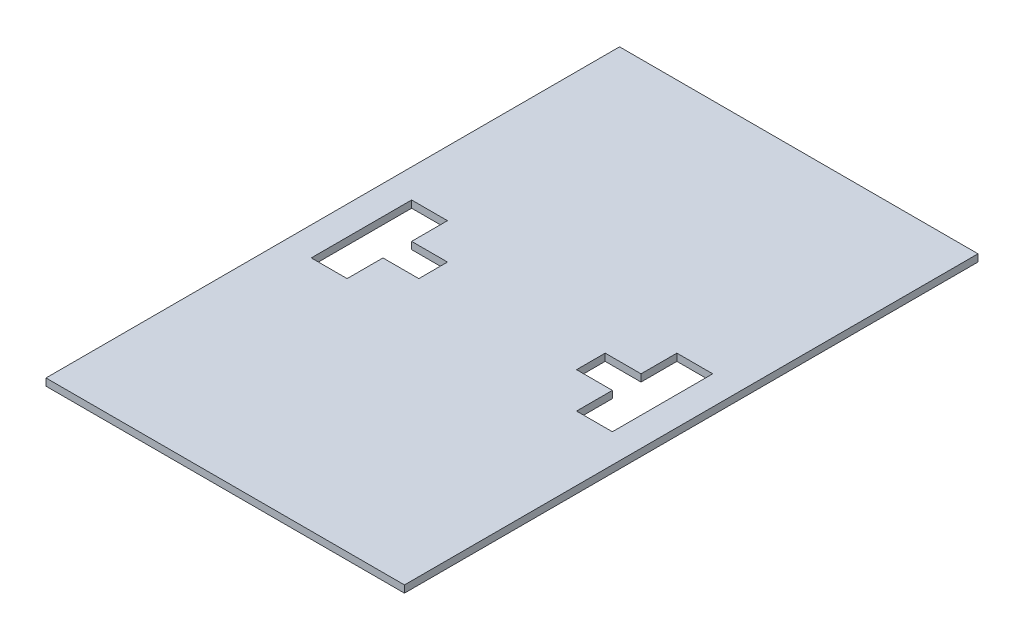
ISO-10303-21;
HEADER;
FILE_DESCRIPTION(('STEP AP214'),'2;1');
FILE_NAME('part.step','',(''),(''),'','','');
FILE_SCHEMA(('AUTOMOTIVE_DESIGN { 1 0 10303 214 1 1 1 1 }'));
ENDSEC;
DATA;
#1=APPLICATION_CONTEXT('core data for automotive mechanical design processes');
#2=APPLICATION_PROTOCOL_DEFINITION('international standard','automotive_design',2000,#1);
#3=PRODUCT_CONTEXT('',#1,'mechanical');
#4=PRODUCT('Part','Part','',(#3));
#5=PRODUCT_RELATED_PRODUCT_CATEGORY('part','',(#4));
#6=PRODUCT_DEFINITION_FORMATION('','',#4);
#7=PRODUCT_DEFINITION_CONTEXT('part definition',#1,'design');
#8=PRODUCT_DEFINITION('design','',#6,#7);
#9=PRODUCT_DEFINITION_SHAPE('','',#8);
#10=(LENGTH_UNIT() NAMED_UNIT(*) SI_UNIT(.MILLI.,.METRE.));
#11=(NAMED_UNIT(*) PLANE_ANGLE_UNIT() SI_UNIT($,.RADIAN.));
#12=(NAMED_UNIT(*) SI_UNIT($,.STERADIAN.) SOLID_ANGLE_UNIT());
#13=UNCERTAINTY_MEASURE_WITH_UNIT(LENGTH_MEASURE(1.E-05),#10,'distance_accuracy_value','');
#14=(GEOMETRIC_REPRESENTATION_CONTEXT(3) GLOBAL_UNCERTAINTY_ASSIGNED_CONTEXT((#13)) GLOBAL_UNIT_ASSIGNED_CONTEXT((#10,
#11,#12)) REPRESENTATION_CONTEXT('',''));
#15=CARTESIAN_POINT('',(0.,0.,0.));
#16=DIRECTION('',(0.,0.,1.));
#17=DIRECTION('',(1.,0.,0.));
#18=AXIS2_PLACEMENT_3D('',#15,#16,#17);
#19=CARTESIAN_POINT('',(0.,10.,0.));
#20=DIRECTION('',(0.,1.,0.));
#21=DIRECTION('',(0.,0.,1.));
#22=AXIS2_PLACEMENT_3D('',#19,#20,#21);
#23=PLANE('',#22);
#24=DIRECTION('',(0.,0.,1.));
#25=VECTOR('',#24,1.);
#26=CARTESIAN_POINT('',(-210.,10.,70.));
#27=LINE('',#26,#25);
#28=CARTESIAN_POINT('',(-210.,10.,-70.));
#29=VERTEX_POINT('',#28);
#30=CARTESIAN_POINT('',(-210.,10.,70.));
#31=VERTEX_POINT('',#30);
#32=EDGE_CURVE('E253',#29,#31,#27,.T.);
#33=ORIENTED_EDGE('',*,*,#32,.F.);
#34=DIRECTION('',(-1.,0.,0.));
#35=VECTOR('',#34,1.);
#36=CARTESIAN_POINT('',(-160.,10.,-70.));
#37=LINE('',#36,#35);
#38=CARTESIAN_POINT('',(-160.,10.,-70.));
#39=VERTEX_POINT('',#38);
#40=EDGE_CURVE('E276',#39,#29,#37,.T.);
#41=ORIENTED_EDGE('',*,*,#40,.F.);
#42=DIRECTION('',(0.,0.,-1.));
#43=VECTOR('',#42,1.);
#44=CARTESIAN_POINT('',(-160.,10.,-70.));
#45=LINE('',#44,#43);
#46=CARTESIAN_POINT('',(-160.,10.,-20.));
#47=VERTEX_POINT('',#46);
#48=EDGE_CURVE('E327',#47,#39,#45,.T.);
#49=ORIENTED_EDGE('',*,*,#48,.F.);
#50=DIRECTION('',(-1.,0.,0.));
#51=VECTOR('',#50,1.);
#52=CARTESIAN_POINT('',(-110.,10.,-20.));
#53=LINE('',#52,#51);
#54=CARTESIAN_POINT('',(-110.,10.,-20.));
#55=VERTEX_POINT('',#54);
#56=EDGE_CURVE('E323',#55,#47,#53,.T.);
#57=ORIENTED_EDGE('',*,*,#56,.F.);
#58=DIRECTION('',(0.,0.,-1.));
#59=VECTOR('',#58,1.);
#60=CARTESIAN_POINT('',(-110.,10.,20.));
#61=LINE('',#60,#59);
#62=CARTESIAN_POINT('',(-110.,10.,20.));
#63=VERTEX_POINT('',#62);
#64=EDGE_CURVE('E319',#63,#55,#61,.T.);
#65=ORIENTED_EDGE('',*,*,#64,.F.);
#66=DIRECTION('',(1.,0.,0.));
#67=VECTOR('',#66,1.);
#68=CARTESIAN_POINT('',(-110.,10.,20.));
#69=LINE('',#68,#67);
#70=CARTESIAN_POINT('',(-160.,10.,20.));
#71=VERTEX_POINT('',#70);
#72=EDGE_CURVE('E315',#71,#63,#69,.T.);
#73=ORIENTED_EDGE('',*,*,#72,.F.);
#74=DIRECTION('',(0.,0.,-1.));
#75=VECTOR('',#74,1.);
#76=CARTESIAN_POINT('',(-160.,10.,20.));
#77=LINE('',#76,#75);
#78=CARTESIAN_POINT('',(-160.,10.,70.));
#79=VERTEX_POINT('',#78);
#80=EDGE_CURVE('E311',#79,#71,#77,.T.);
#81=ORIENTED_EDGE('',*,*,#80,.F.);
#82=DIRECTION('',(1.,0.,0.));
#83=VECTOR('',#82,1.);
#84=CARTESIAN_POINT('',(-160.,10.,70.));
#85=LINE('',#84,#83);
#86=EDGE_CURVE('E307',#31,#79,#85,.T.);
#87=ORIENTED_EDGE('',*,*,#86,.F.);
#88=EDGE_LOOP('',(#33,#41,#49,#57,#65,#73,#81,#87));
#89=FACE_BOUND('',#88,.T.);
#90=DIRECTION('',(0.,0.,1.));
#91=VECTOR('',#90,1.);
#92=CARTESIAN_POINT('',(-250.,10.,400.));
#93=LINE('',#92,#91);
#94=CARTESIAN_POINT('',(-250.,10.,-400.));
#95=VERTEX_POINT('',#94);
#96=CARTESIAN_POINT('',(-250.,10.,400.));
#97=VERTEX_POINT('',#96);
#98=EDGE_CURVE('E359',#95,#97,#93,.T.);
#99=ORIENTED_EDGE('',*,*,#98,.T.);
#100=DIRECTION('',(1.,0.,0.));
#101=VECTOR('',#100,1.);
#102=CARTESIAN_POINT('',(250.,10.,400.));
#103=LINE('',#102,#101);
#104=CARTESIAN_POINT('',(250.,10.,400.));
#105=VERTEX_POINT('',#104);
#106=EDGE_CURVE('E363',#97,#105,#103,.T.);
#107=ORIENTED_EDGE('',*,*,#106,.T.);
#108=DIRECTION('',(0.,0.,-1.));
#109=VECTOR('',#108,1.);
#110=CARTESIAN_POINT('',(250.,10.,400.));
#111=LINE('',#110,#109);
#112=CARTESIAN_POINT('',(250.,10.,-400.));
#113=VERTEX_POINT('',#112);
#114=EDGE_CURVE('E367',#105,#113,#111,.T.);
#115=ORIENTED_EDGE('',*,*,#114,.T.);
#116=DIRECTION('',(-1.,0.,0.));
#117=VECTOR('',#116,1.);
#118=CARTESIAN_POINT('',(250.,10.,-400.));
#119=LINE('',#118,#117);
#120=EDGE_CURVE('E370',#113,#95,#119,.T.);
#121=ORIENTED_EDGE('',*,*,#120,.T.);
#122=EDGE_LOOP('',(#99,#107,#115,#121));
#123=FACE_BOUND('',#122,.T.);
#124=DIRECTION('',(1.,0.,0.));
#125=VECTOR('',#124,1.);
#126=CARTESIAN_POINT('',(160.,10.,-70.));
#127=LINE('',#126,#125);
#128=CARTESIAN_POINT('',(160.,10.,-70.));
#129=VERTEX_POINT('',#128);
#130=CARTESIAN_POINT('',(210.,10.,-70.));
#131=VERTEX_POINT('',#130);
#132=EDGE_CURVE('E228',#129,#131,#127,.T.);
#133=ORIENTED_EDGE('',*,*,#132,.T.);
#134=DIRECTION('',(0.,0.,1.));
#135=VECTOR('',#134,1.);
#136=CARTESIAN_POINT('',(210.,10.,70.));
#137=LINE('',#136,#135);
#138=CARTESIAN_POINT('',(210.,10.,70.));
#139=VERTEX_POINT('',#138);
#140=EDGE_CURVE('E61',#131,#139,#137,.T.);
#141=ORIENTED_EDGE('',*,*,#140,.T.);
#142=DIRECTION('',(-1.,0.,0.));
#143=VECTOR('',#142,1.);
#144=CARTESIAN_POINT('',(160.,10.,70.));
#145=LINE('',#144,#143);
#146=CARTESIAN_POINT('',(160.,10.,70.));
#147=VERTEX_POINT('',#146);
#148=EDGE_CURVE('E203',#139,#147,#145,.T.);
#149=ORIENTED_EDGE('',*,*,#148,.T.);
#150=DIRECTION('',(0.,0.,-1.));
#151=VECTOR('',#150,1.);
#152=CARTESIAN_POINT('',(160.,10.,20.));
#153=LINE('',#152,#151);
#154=CARTESIAN_POINT('',(160.,10.,20.));
#155=VERTEX_POINT('',#154);
#156=EDGE_CURVE('E207',#147,#155,#153,.T.);
#157=ORIENTED_EDGE('',*,*,#156,.T.);
#158=DIRECTION('',(-1.,0.,0.));
#159=VECTOR('',#158,1.);
#160=CARTESIAN_POINT('',(110.,10.,20.));
#161=LINE('',#160,#159);
#162=CARTESIAN_POINT('',(110.,10.,20.));
#163=VERTEX_POINT('',#162);
#164=EDGE_CURVE('E243',#155,#163,#161,.T.);
#165=ORIENTED_EDGE('',*,*,#164,.T.);
#166=DIRECTION('',(0.,0.,-1.));
#167=VECTOR('',#166,1.);
#168=CARTESIAN_POINT('',(110.,10.,20.));
#169=LINE('',#168,#167);
#170=CARTESIAN_POINT('',(110.,10.,-20.));
#171=VERTEX_POINT('',#170);
#172=EDGE_CURVE('E239',#163,#171,#169,.T.);
#173=ORIENTED_EDGE('',*,*,#172,.T.);
#174=DIRECTION('',(1.,0.,0.));
#175=VECTOR('',#174,1.);
#176=CARTESIAN_POINT('',(110.,10.,-20.));
#177=LINE('',#176,#175);
#178=CARTESIAN_POINT('',(160.,10.,-20.));
#179=VERTEX_POINT('',#178);
#180=EDGE_CURVE('E235',#171,#179,#177,.T.);
#181=ORIENTED_EDGE('',*,*,#180,.T.);
#182=DIRECTION('',(0.,0.,-1.));
#183=VECTOR('',#182,1.);
#184=CARTESIAN_POINT('',(160.,10.,-70.));
#185=LINE('',#184,#183);
#186=EDGE_CURVE('E231',#179,#129,#185,.T.);
#187=ORIENTED_EDGE('',*,*,#186,.T.);
#188=EDGE_LOOP('',(#133,#141,#149,#157,#165,#173,#181,#187));
#189=FACE_BOUND('',#188,.T.);
#190=ADVANCED_FACE('F45',(#89,#123,#189),#23,.T.);
#191=CARTESIAN_POINT('',(0.,0.,0.));
#192=DIRECTION('',(0.,1.,0.));
#193=DIRECTION('',(0.,0.,1.));
#194=AXIS2_PLACEMENT_3D('',#191,#192,#193);
#195=PLANE('',#194);
#196=DIRECTION('',(0.,0.,1.));
#197=VECTOR('',#196,1.);
#198=CARTESIAN_POINT('',(-250.,0.,400.));
#199=LINE('',#198,#197);
#200=CARTESIAN_POINT('',(-250.,0.,-400.));
#201=VERTEX_POINT('',#200);
#202=CARTESIAN_POINT('',(-250.,0.,400.));
#203=VERTEX_POINT('',#202);
#204=EDGE_CURVE('E337',#201,#203,#199,.T.);
#205=ORIENTED_EDGE('',*,*,#204,.F.);
#206=DIRECTION('',(-1.,0.,0.));
#207=VECTOR('',#206,1.);
#208=CARTESIAN_POINT('',(250.,0.,-400.));
#209=LINE('',#208,#207);
#210=CARTESIAN_POINT('',(250.,0.,-400.));
#211=VERTEX_POINT('',#210);
#212=EDGE_CURVE('E364',#211,#201,#209,.T.);
#213=ORIENTED_EDGE('',*,*,#212,.F.);
#214=DIRECTION('',(0.,0.,-1.));
#215=VECTOR('',#214,1.);
#216=CARTESIAN_POINT('',(250.,0.,400.));
#217=LINE('',#216,#215);
#218=CARTESIAN_POINT('',(250.,0.,400.));
#219=VERTEX_POINT('',#218);
#220=EDGE_CURVE('E380',#219,#211,#217,.T.);
#221=ORIENTED_EDGE('',*,*,#220,.F.);
#222=DIRECTION('',(1.,0.,0.));
#223=VECTOR('',#222,1.);
#224=CARTESIAN_POINT('',(250.,0.,400.));
#225=LINE('',#224,#223);
#226=EDGE_CURVE('E377',#203,#219,#225,.T.);
#227=ORIENTED_EDGE('',*,*,#226,.F.);
#228=EDGE_LOOP('',(#205,#213,#221,#227));
#229=FACE_BOUND('',#228,.T.);
#230=DIRECTION('',(-1.,0.,0.));
#231=VECTOR('',#230,1.);
#232=CARTESIAN_POINT('',(-160.,0.,-70.));
#233=LINE('',#232,#231);
#234=CARTESIAN_POINT('',(-160.,0.,-70.));
#235=VERTEX_POINT('',#234);
#236=CARTESIAN_POINT('',(-210.,0.,-70.));
#237=VERTEX_POINT('',#236);
#238=EDGE_CURVE('E300',#235,#237,#233,.T.);
#239=ORIENTED_EDGE('',*,*,#238,.T.);
#240=DIRECTION('',(0.,0.,1.));
#241=VECTOR('',#240,1.);
#242=CARTESIAN_POINT('',(-210.,0.,70.));
#243=LINE('',#242,#241);
#244=CARTESIAN_POINT('',(-210.,0.,70.));
#245=VERTEX_POINT('',#244);
#246=EDGE_CURVE('E271',#237,#245,#243,.T.);
#247=ORIENTED_EDGE('',*,*,#246,.T.);
#248=DIRECTION('',(1.,0.,0.));
#249=VECTOR('',#248,1.);
#250=CARTESIAN_POINT('',(-160.,0.,70.));
#251=LINE('',#250,#249);
#252=CARTESIAN_POINT('',(-160.,0.,70.));
#253=VERTEX_POINT('',#252);
#254=EDGE_CURVE('E275',#245,#253,#251,.T.);
#255=ORIENTED_EDGE('',*,*,#254,.T.);
#256=DIRECTION('',(0.,0.,-1.));
#257=VECTOR('',#256,1.);
#258=CARTESIAN_POINT('',(-160.,0.,20.));
#259=LINE('',#258,#257);
#260=CARTESIAN_POINT('',(-160.,0.,20.));
#261=VERTEX_POINT('',#260);
#262=EDGE_CURVE('E280',#253,#261,#259,.T.);
#263=ORIENTED_EDGE('',*,*,#262,.T.);
#264=DIRECTION('',(1.,0.,0.));
#265=VECTOR('',#264,1.);
#266=CARTESIAN_POINT('',(-110.,0.,20.));
#267=LINE('',#266,#265);
#268=CARTESIAN_POINT('',(-110.,0.,20.));
#269=VERTEX_POINT('',#268);
#270=EDGE_CURVE('E284',#261,#269,#267,.T.);
#271=ORIENTED_EDGE('',*,*,#270,.T.);
#272=DIRECTION('',(0.,0.,-1.));
#273=VECTOR('',#272,1.);
#274=CARTESIAN_POINT('',(-110.,0.,20.));
#275=LINE('',#274,#273);
#276=CARTESIAN_POINT('',(-110.,0.,-20.));
#277=VERTEX_POINT('',#276);
#278=EDGE_CURVE('E288',#269,#277,#275,.T.);
#279=ORIENTED_EDGE('',*,*,#278,.T.);
#280=DIRECTION('',(-1.,0.,0.));
#281=VECTOR('',#280,1.);
#282=CARTESIAN_POINT('',(-110.,0.,-20.));
#283=LINE('',#282,#281);
#284=CARTESIAN_POINT('',(-160.,0.,-20.));
#285=VERTEX_POINT('',#284);
#286=EDGE_CURVE('E292',#277,#285,#283,.T.);
#287=ORIENTED_EDGE('',*,*,#286,.T.);
#288=DIRECTION('',(0.,0.,-1.));
#289=VECTOR('',#288,1.);
#290=CARTESIAN_POINT('',(-160.,0.,-70.));
#291=LINE('',#290,#289);
#292=EDGE_CURVE('E296',#285,#235,#291,.T.);
#293=ORIENTED_EDGE('',*,*,#292,.T.);
#294=EDGE_LOOP('',(#239,#247,#255,#263,#271,#279,#287,#293));
#295=FACE_BOUND('',#294,.T.);
#296=DIRECTION('',(0.,0.,1.));
#297=VECTOR('',#296,1.);
#298=CARTESIAN_POINT('',(210.,0.,70.));
#299=LINE('',#298,#297);
#300=CARTESIAN_POINT('',(210.,0.,-70.));
#301=VERTEX_POINT('',#300);
#302=CARTESIAN_POINT('',(210.,0.,70.));
#303=VERTEX_POINT('',#302);
#304=EDGE_CURVE('E192',#301,#303,#299,.T.);
#305=ORIENTED_EDGE('',*,*,#304,.F.);
#306=DIRECTION('',(1.,0.,0.));
#307=VECTOR('',#306,1.);
#308=CARTESIAN_POINT('',(160.,0.,-70.));
#309=LINE('',#308,#307);
#310=CARTESIAN_POINT('',(160.,0.,-70.));
#311=VERTEX_POINT('',#310);
#312=EDGE_CURVE('E183',#311,#301,#309,.T.);
#313=ORIENTED_EDGE('',*,*,#312,.F.);
#314=DIRECTION('',(0.,0.,-1.));
#315=VECTOR('',#314,1.);
#316=CARTESIAN_POINT('',(160.,0.,-70.));
#317=LINE('',#316,#315);
#318=CARTESIAN_POINT('',(160.,0.,-20.));
#319=VERTEX_POINT('',#318);
#320=EDGE_CURVE('E191',#319,#311,#317,.T.);
#321=ORIENTED_EDGE('',*,*,#320,.F.);
#322=DIRECTION('',(1.,0.,0.));
#323=VECTOR('',#322,1.);
#324=CARTESIAN_POINT('',(110.,0.,-20.));
#325=LINE('',#324,#323);
#326=CARTESIAN_POINT('',(110.,0.,-20.));
#327=VERTEX_POINT('',#326);
#328=EDGE_CURVE('E212',#327,#319,#325,.T.);
#329=ORIENTED_EDGE('',*,*,#328,.F.);
#330=DIRECTION('',(0.,0.,-1.));
#331=VECTOR('',#330,1.);
#332=CARTESIAN_POINT('',(110.,0.,20.));
#333=LINE('',#332,#331);
#334=CARTESIAN_POINT('',(110.,0.,20.));
#335=VERTEX_POINT('',#334);
#336=EDGE_CURVE('E215',#335,#327,#333,.T.);
#337=ORIENTED_EDGE('',*,*,#336,.F.);
#338=DIRECTION('',(-1.,0.,0.));
#339=VECTOR('',#338,1.);
#340=CARTESIAN_POINT('',(110.,0.,20.));
#341=LINE('',#340,#339);
#342=CARTESIAN_POINT('',(160.,0.,20.));
#343=VERTEX_POINT('',#342);
#344=EDGE_CURVE('E218',#343,#335,#341,.T.);
#345=ORIENTED_EDGE('',*,*,#344,.F.);
#346=DIRECTION('',(0.,0.,-1.));
#347=VECTOR('',#346,1.);
#348=CARTESIAN_POINT('',(160.,0.,20.));
#349=LINE('',#348,#347);
#350=CARTESIAN_POINT('',(160.,0.,70.));
#351=VERTEX_POINT('',#350);
#352=EDGE_CURVE('E221',#351,#343,#349,.T.);
#353=ORIENTED_EDGE('',*,*,#352,.F.);
#354=DIRECTION('',(-1.,0.,0.));
#355=VECTOR('',#354,1.);
#356=CARTESIAN_POINT('',(160.,0.,70.));
#357=LINE('',#356,#355);
#358=EDGE_CURVE('E197',#303,#351,#357,.T.);
#359=ORIENTED_EDGE('',*,*,#358,.F.);
#360=EDGE_LOOP('',(#305,#313,#321,#329,#337,#345,#353,#359));
#361=FACE_BOUND('',#360,.T.);
#362=ADVANCED_FACE('F200',(#229,#295,#361),#195,.F.);
#363=CARTESIAN_POINT('',(-250.,10.,400.));
#364=DIRECTION('',(1.,0.,0.));
#365=DIRECTION('',(0.,0.,-1.));
#366=AXIS2_PLACEMENT_3D('',#363,#364,#365);
#367=PLANE('',#366);
#368=ORIENTED_EDGE('',*,*,#204,.T.);
#369=DIRECTION('',(0.,-1.,0.));
#370=VECTOR('',#369,1.);
#371=CARTESIAN_POINT('',(-250.,10.,400.));
#372=LINE('',#371,#370);
#373=EDGE_CURVE('E11',#97,#203,#372,.T.);
#374=ORIENTED_EDGE('',*,*,#373,.F.);
#375=ORIENTED_EDGE('',*,*,#98,.F.);
#376=DIRECTION('',(0.,-1.,0.));
#377=VECTOR('',#376,1.);
#378=CARTESIAN_POINT('',(-250.,10.,-400.));
#379=LINE('',#378,#377);
#380=EDGE_CURVE('E373',#95,#201,#379,.T.);
#381=ORIENTED_EDGE('',*,*,#380,.T.);
#382=EDGE_LOOP('',(#368,#374,#375,#381));
#383=FACE_BOUND('',#382,.T.);
#384=ADVANCED_FACE('F47',(#383),#367,.F.);
#385=CARTESIAN_POINT('',(250.,10.,400.));
#386=DIRECTION('',(0.,0.,-1.));
#387=DIRECTION('',(-1.,0.,0.));
#388=AXIS2_PLACEMENT_3D('',#385,#386,#387);
#389=PLANE('',#388);
#390=ORIENTED_EDGE('',*,*,#226,.T.);
#391=DIRECTION('',(0.,-1.,0.));
#392=VECTOR('',#391,1.);
#393=CARTESIAN_POINT('',(250.,10.,400.));
#394=LINE('',#393,#392);
#395=EDGE_CURVE('E54',#105,#219,#394,.T.);
#396=ORIENTED_EDGE('',*,*,#395,.F.);
#397=ORIENTED_EDGE('',*,*,#106,.F.);
#398=ORIENTED_EDGE('',*,*,#373,.T.);
#399=EDGE_LOOP('',(#390,#396,#397,#398));
#400=FACE_BOUND('',#399,.T.);
#401=ADVANCED_FACE('F413',(#400),#389,.F.);
#402=CARTESIAN_POINT('',(250.,10.,400.));
#403=DIRECTION('',(-1.,0.,0.));
#404=DIRECTION('',(0.,0.,1.));
#405=AXIS2_PLACEMENT_3D('',#402,#403,#404);
#406=PLANE('',#405);
#407=ORIENTED_EDGE('',*,*,#220,.T.);
#408=DIRECTION('',(0.,-1.,0.));
#409=VECTOR('',#408,1.);
#410=CARTESIAN_POINT('',(250.,10.,-400.));
#411=LINE('',#410,#409);
#412=EDGE_CURVE('E388',#113,#211,#411,.T.);
#413=ORIENTED_EDGE('',*,*,#412,.F.);
#414=ORIENTED_EDGE('',*,*,#114,.F.);
#415=ORIENTED_EDGE('',*,*,#395,.T.);
#416=EDGE_LOOP('',(#407,#413,#414,#415));
#417=FACE_BOUND('',#416,.T.);
#418=ADVANCED_FACE('F397',(#417),#406,.F.);
#419=CARTESIAN_POINT('',(250.,10.,-400.));
#420=DIRECTION('',(0.,0.,1.));
#421=DIRECTION('',(1.,0.,0.));
#422=AXIS2_PLACEMENT_3D('',#419,#420,#421);
#423=PLANE('',#422);
#424=ORIENTED_EDGE('',*,*,#212,.T.);
#425=ORIENTED_EDGE('',*,*,#380,.F.);
#426=ORIENTED_EDGE('',*,*,#120,.F.);
#427=ORIENTED_EDGE('',*,*,#412,.T.);
#428=EDGE_LOOP('',(#424,#425,#426,#427));
#429=FACE_BOUND('',#428,.T.);
#430=ADVANCED_FACE('F406',(#429),#423,.F.);
#431=CARTESIAN_POINT('',(-210.,0.,70.));
#432=DIRECTION('',(-1.,0.,0.));
#433=DIRECTION('',(0.,0.,1.));
#434=AXIS2_PLACEMENT_3D('',#431,#432,#433);
#435=PLANE('',#434);
#436=ORIENTED_EDGE('',*,*,#32,.T.);
#437=DIRECTION('',(0.,1.,0.));
#438=VECTOR('',#437,1.);
#439=CARTESIAN_POINT('',(-210.,0.,70.));
#440=LINE('',#439,#438);
#441=EDGE_CURVE('E304',#245,#31,#440,.T.);
#442=ORIENTED_EDGE('',*,*,#441,.F.);
#443=ORIENTED_EDGE('',*,*,#246,.F.);
#444=DIRECTION('',(0.,1.,0.));
#445=VECTOR('',#444,1.);
#446=CARTESIAN_POINT('',(-210.,0.,-70.));
#447=LINE('',#446,#445);
#448=EDGE_CURVE('E334',#237,#29,#447,.T.);
#449=ORIENTED_EDGE('',*,*,#448,.T.);
#450=EDGE_LOOP('',(#436,#442,#443,#449));
#451=FACE_BOUND('',#450,.T.);
#452=ADVANCED_FACE('F429',(#451),#435,.F.);
#453=CARTESIAN_POINT('',(-160.,0.,-70.));
#454=DIRECTION('',(0.,0.,-1.));
#455=DIRECTION('',(-1.,0.,0.));
#456=AXIS2_PLACEMENT_3D('',#453,#454,#455);
#457=PLANE('',#456);
#458=ORIENTED_EDGE('',*,*,#40,.T.);
#459=ORIENTED_EDGE('',*,*,#448,.F.);
#460=ORIENTED_EDGE('',*,*,#238,.F.);
#461=DIRECTION('',(0.,1.,0.));
#462=VECTOR('',#461,1.);
#463=CARTESIAN_POINT('',(-160.,0.,-70.));
#464=LINE('',#463,#462);
#465=EDGE_CURVE('E338',#235,#39,#464,.T.);
#466=ORIENTED_EDGE('',*,*,#465,.T.);
#467=EDGE_LOOP('',(#458,#459,#460,#466));
#468=FACE_BOUND('',#467,.T.);
#469=ADVANCED_FACE('F436',(#468),#457,.F.);
#470=CARTESIAN_POINT('',(-160.,0.,-70.));
#471=DIRECTION('',(1.,0.,0.));
#472=DIRECTION('',(0.,0.,-1.));
#473=AXIS2_PLACEMENT_3D('',#470,#471,#472);
#474=PLANE('',#473);
#475=ORIENTED_EDGE('',*,*,#48,.T.);
#476=ORIENTED_EDGE('',*,*,#465,.F.);
#477=ORIENTED_EDGE('',*,*,#292,.F.);
#478=DIRECTION('',(0.,1.,0.));
#479=VECTOR('',#478,1.);
#480=CARTESIAN_POINT('',(-160.,0.,-20.));
#481=LINE('',#480,#479);
#482=EDGE_CURVE('E341',#285,#47,#481,.T.);
#483=ORIENTED_EDGE('',*,*,#482,.T.);
#484=EDGE_LOOP('',(#475,#476,#477,#483));
#485=FACE_BOUND('',#484,.T.);
#486=ADVANCED_FACE('F441',(#485),#474,.F.);
#487=CARTESIAN_POINT('',(-110.,0.,-20.));
#488=DIRECTION('',(0.,0.,-1.));
#489=DIRECTION('',(-1.,0.,0.));
#490=AXIS2_PLACEMENT_3D('',#487,#488,#489);
#491=PLANE('',#490);
#492=ORIENTED_EDGE('',*,*,#56,.T.);
#493=ORIENTED_EDGE('',*,*,#482,.F.);
#494=ORIENTED_EDGE('',*,*,#286,.F.);
#495=DIRECTION('',(0.,1.,0.));
#496=VECTOR('',#495,1.);
#497=CARTESIAN_POINT('',(-110.,0.,-20.));
#498=LINE('',#497,#496);
#499=EDGE_CURVE('E344',#277,#55,#498,.T.);
#500=ORIENTED_EDGE('',*,*,#499,.T.);
#501=EDGE_LOOP('',(#492,#493,#494,#500));
#502=FACE_BOUND('',#501,.T.);
#503=ADVANCED_FACE('F464',(#502),#491,.F.);
#504=CARTESIAN_POINT('',(-110.,0.,20.));
#505=DIRECTION('',(1.,0.,0.));
#506=DIRECTION('',(0.,0.,-1.));
#507=AXIS2_PLACEMENT_3D('',#504,#505,#506);
#508=PLANE('',#507);
#509=ORIENTED_EDGE('',*,*,#64,.T.);
#510=ORIENTED_EDGE('',*,*,#499,.F.);
#511=ORIENTED_EDGE('',*,*,#278,.F.);
#512=DIRECTION('',(0.,1.,0.));
#513=VECTOR('',#512,1.);
#514=CARTESIAN_POINT('',(-110.,0.,20.));
#515=LINE('',#514,#513);
#516=EDGE_CURVE('E347',#269,#63,#515,.T.);
#517=ORIENTED_EDGE('',*,*,#516,.T.);
#518=EDGE_LOOP('',(#509,#510,#511,#517));
#519=FACE_BOUND('',#518,.T.);
#520=ADVANCED_FACE('F467',(#519),#508,.F.);
#521=CARTESIAN_POINT('',(-110.,0.,20.));
#522=DIRECTION('',(0.,0.,1.));
#523=DIRECTION('',(1.,0.,0.));
#524=AXIS2_PLACEMENT_3D('',#521,#522,#523);
#525=PLANE('',#524);
#526=ORIENTED_EDGE('',*,*,#72,.T.);
#527=ORIENTED_EDGE('',*,*,#516,.F.);
#528=ORIENTED_EDGE('',*,*,#270,.F.);
#529=DIRECTION('',(0.,1.,0.));
#530=VECTOR('',#529,1.);
#531=CARTESIAN_POINT('',(-160.,0.,20.));
#532=LINE('',#531,#530);
#533=EDGE_CURVE('E350',#261,#71,#532,.T.);
#534=ORIENTED_EDGE('',*,*,#533,.T.);
#535=EDGE_LOOP('',(#526,#527,#528,#534));
#536=FACE_BOUND('',#535,.T.);
#537=ADVANCED_FACE('F469',(#536),#525,.F.);
#538=CARTESIAN_POINT('',(-160.,0.,20.));
#539=DIRECTION('',(1.,0.,0.));
#540=DIRECTION('',(0.,0.,-1.));
#541=AXIS2_PLACEMENT_3D('',#538,#539,#540);
#542=PLANE('',#541);
#543=ORIENTED_EDGE('',*,*,#80,.T.);
#544=ORIENTED_EDGE('',*,*,#533,.F.);
#545=ORIENTED_EDGE('',*,*,#262,.F.);
#546=DIRECTION('',(0.,1.,0.));
#547=VECTOR('',#546,1.);
#548=CARTESIAN_POINT('',(-160.,0.,70.));
#549=LINE('',#548,#547);
#550=EDGE_CURVE('E353',#253,#79,#549,.T.);
#551=ORIENTED_EDGE('',*,*,#550,.T.);
#552=EDGE_LOOP('',(#543,#544,#545,#551));
#553=FACE_BOUND('',#552,.T.);
#554=ADVANCED_FACE('F455',(#553),#542,.F.);
#555=CARTESIAN_POINT('',(-160.,0.,70.));
#556=DIRECTION('',(0.,0.,1.));
#557=DIRECTION('',(1.,0.,0.));
#558=AXIS2_PLACEMENT_3D('',#555,#556,#557);
#559=PLANE('',#558);
#560=ORIENTED_EDGE('',*,*,#86,.T.);
#561=ORIENTED_EDGE('',*,*,#550,.F.);
#562=ORIENTED_EDGE('',*,*,#254,.F.);
#563=ORIENTED_EDGE('',*,*,#441,.T.);
#564=EDGE_LOOP('',(#560,#561,#562,#563));
#565=FACE_BOUND('',#564,.T.);
#566=ADVANCED_FACE('F449',(#565),#559,.F.);
#567=CARTESIAN_POINT('',(210.,0.,70.));
#568=DIRECTION('',(-1.,0.,0.));
#569=DIRECTION('',(0.,0.,1.));
#570=AXIS2_PLACEMENT_3D('',#567,#568,#569);
#571=PLANE('',#570);
#572=ORIENTED_EDGE('',*,*,#140,.F.);
#573=DIRECTION('',(0.,1.,0.));
#574=VECTOR('',#573,1.);
#575=CARTESIAN_POINT('',(210.,0.,-70.));
#576=LINE('',#575,#574);
#577=EDGE_CURVE('E185',#301,#131,#576,.T.);
#578=ORIENTED_EDGE('',*,*,#577,.F.);
#579=ORIENTED_EDGE('',*,*,#304,.T.);
#580=DIRECTION('',(0.,1.,0.));
#581=VECTOR('',#580,1.);
#582=CARTESIAN_POINT('',(210.,0.,70.));
#583=LINE('',#582,#581);
#584=EDGE_CURVE('E250',#303,#139,#583,.T.);
#585=ORIENTED_EDGE('',*,*,#584,.T.);
#586=EDGE_LOOP('',(#572,#578,#579,#585));
#587=FACE_BOUND('',#586,.T.);
#588=ADVANCED_FACE('F194',(#587),#571,.T.);
#589=CARTESIAN_POINT('',(160.,0.,70.));
#590=DIRECTION('',(0.,0.,-1.));
#591=DIRECTION('',(-1.,0.,0.));
#592=AXIS2_PLACEMENT_3D('',#589,#590,#591);
#593=PLANE('',#592);
#594=ORIENTED_EDGE('',*,*,#148,.F.);
#595=ORIENTED_EDGE('',*,*,#584,.F.);
#596=ORIENTED_EDGE('',*,*,#358,.T.);
#597=DIRECTION('',(0.,1.,0.));
#598=VECTOR('',#597,1.);
#599=CARTESIAN_POINT('',(160.,0.,70.));
#600=LINE('',#599,#598);
#601=EDGE_CURVE('E254',#351,#147,#600,.T.);
#602=ORIENTED_EDGE('',*,*,#601,.T.);
#603=EDGE_LOOP('',(#594,#595,#596,#602));
#604=FACE_BOUND('',#603,.T.);
#605=ADVANCED_FACE('F483',(#604),#593,.T.);
#606=CARTESIAN_POINT('',(160.,0.,20.));
#607=DIRECTION('',(1.,0.,0.));
#608=DIRECTION('',(0.,0.,-1.));
#609=AXIS2_PLACEMENT_3D('',#606,#607,#608);
#610=PLANE('',#609);
#611=ORIENTED_EDGE('',*,*,#156,.F.);
#612=ORIENTED_EDGE('',*,*,#601,.F.);
#613=ORIENTED_EDGE('',*,*,#352,.T.);
#614=DIRECTION('',(0.,1.,0.));
#615=VECTOR('',#614,1.);
#616=CARTESIAN_POINT('',(160.,0.,20.));
#617=LINE('',#616,#615);
#618=EDGE_CURVE('E257',#343,#155,#617,.T.);
#619=ORIENTED_EDGE('',*,*,#618,.T.);
#620=EDGE_LOOP('',(#611,#612,#613,#619));
#621=FACE_BOUND('',#620,.T.);
#622=ADVANCED_FACE('F488',(#621),#610,.T.);
#623=CARTESIAN_POINT('',(110.,0.,20.));
#624=DIRECTION('',(0.,0.,-1.));
#625=DIRECTION('',(-1.,0.,0.));
#626=AXIS2_PLACEMENT_3D('',#623,#624,#625);
#627=PLANE('',#626);
#628=ORIENTED_EDGE('',*,*,#164,.F.);
#629=ORIENTED_EDGE('',*,*,#618,.F.);
#630=ORIENTED_EDGE('',*,*,#344,.T.);
#631=DIRECTION('',(0.,1.,0.));
#632=VECTOR('',#631,1.);
#633=CARTESIAN_POINT('',(110.,0.,20.));
#634=LINE('',#633,#632);
#635=EDGE_CURVE('E260',#335,#163,#634,.T.);
#636=ORIENTED_EDGE('',*,*,#635,.T.);
#637=EDGE_LOOP('',(#628,#629,#630,#636));
#638=FACE_BOUND('',#637,.T.);
#639=ADVANCED_FACE('F539',(#638),#627,.T.);
#640=CARTESIAN_POINT('',(110.,0.,20.));
#641=DIRECTION('',(1.,0.,0.));
#642=DIRECTION('',(0.,0.,-1.));
#643=AXIS2_PLACEMENT_3D('',#640,#641,#642);
#644=PLANE('',#643);
#645=ORIENTED_EDGE('',*,*,#172,.F.);
#646=ORIENTED_EDGE('',*,*,#635,.F.);
#647=ORIENTED_EDGE('',*,*,#336,.T.);
#648=DIRECTION('',(0.,1.,0.));
#649=VECTOR('',#648,1.);
#650=CARTESIAN_POINT('',(110.,0.,-20.));
#651=LINE('',#650,#649);
#652=EDGE_CURVE('E263',#327,#171,#651,.T.);
#653=ORIENTED_EDGE('',*,*,#652,.T.);
#654=EDGE_LOOP('',(#645,#646,#647,#653));
#655=FACE_BOUND('',#654,.T.);
#656=ADVANCED_FACE('F549',(#655),#644,.T.);
#657=CARTESIAN_POINT('',(110.,0.,-20.));
#658=DIRECTION('',(0.,0.,1.));
#659=DIRECTION('',(1.,0.,0.));
#660=AXIS2_PLACEMENT_3D('',#657,#658,#659);
#661=PLANE('',#660);
#662=ORIENTED_EDGE('',*,*,#180,.F.);
#663=ORIENTED_EDGE('',*,*,#652,.F.);
#664=ORIENTED_EDGE('',*,*,#328,.T.);
#665=DIRECTION('',(0.,1.,0.));
#666=VECTOR('',#665,1.);
#667=CARTESIAN_POINT('',(160.,0.,-20.));
#668=LINE('',#667,#666);
#669=EDGE_CURVE('E266',#319,#179,#668,.T.);
#670=ORIENTED_EDGE('',*,*,#669,.T.);
#671=EDGE_LOOP('',(#662,#663,#664,#670));
#672=FACE_BOUND('',#671,.T.);
#673=ADVANCED_FACE('F559',(#672),#661,.T.);
#674=CARTESIAN_POINT('',(160.,0.,-70.));
#675=DIRECTION('',(1.,0.,0.));
#676=DIRECTION('',(0.,0.,-1.));
#677=AXIS2_PLACEMENT_3D('',#674,#675,#676);
#678=PLANE('',#677);
#679=ORIENTED_EDGE('',*,*,#186,.F.);
#680=ORIENTED_EDGE('',*,*,#669,.F.);
#681=ORIENTED_EDGE('',*,*,#320,.T.);
#682=DIRECTION('',(0.,1.,0.));
#683=VECTOR('',#682,1.);
#684=CARTESIAN_POINT('',(160.,0.,-70.));
#685=LINE('',#684,#683);
#686=EDGE_CURVE('E69',#311,#129,#685,.T.);
#687=ORIENTED_EDGE('',*,*,#686,.T.);
#688=EDGE_LOOP('',(#679,#680,#681,#687));
#689=FACE_BOUND('',#688,.T.);
#690=ADVANCED_FACE('F569',(#689),#678,.T.);
#691=CARTESIAN_POINT('',(160.,0.,-70.));
#692=DIRECTION('',(0.,0.,1.));
#693=DIRECTION('',(1.,0.,0.));
#694=AXIS2_PLACEMENT_3D('',#691,#692,#693);
#695=PLANE('',#694);
#696=ORIENTED_EDGE('',*,*,#132,.F.);
#697=ORIENTED_EDGE('',*,*,#686,.F.);
#698=ORIENTED_EDGE('',*,*,#312,.T.);
#699=ORIENTED_EDGE('',*,*,#577,.T.);
#700=EDGE_LOOP('',(#696,#697,#698,#699));
#701=FACE_BOUND('',#700,.T.);
#702=ADVANCED_FACE('F184',(#701),#695,.T.);
#703=CLOSED_SHELL('',(#190,#362,#384,#401,#418,#430,#452,#469,#486,#503,#520,#537,#554,#566,
#588,#605,#622,#639,#656,#673,#690,#702));
#704=MANIFOLD_SOLID_BREP('B2',#703);
#705=ADVANCED_BREP_SHAPE_REPRESENTATION('',(#18,#704),#14);
#706=SHAPE_DEFINITION_REPRESENTATION(#9,#705);
ENDSEC;
END-ISO-10303-21;
